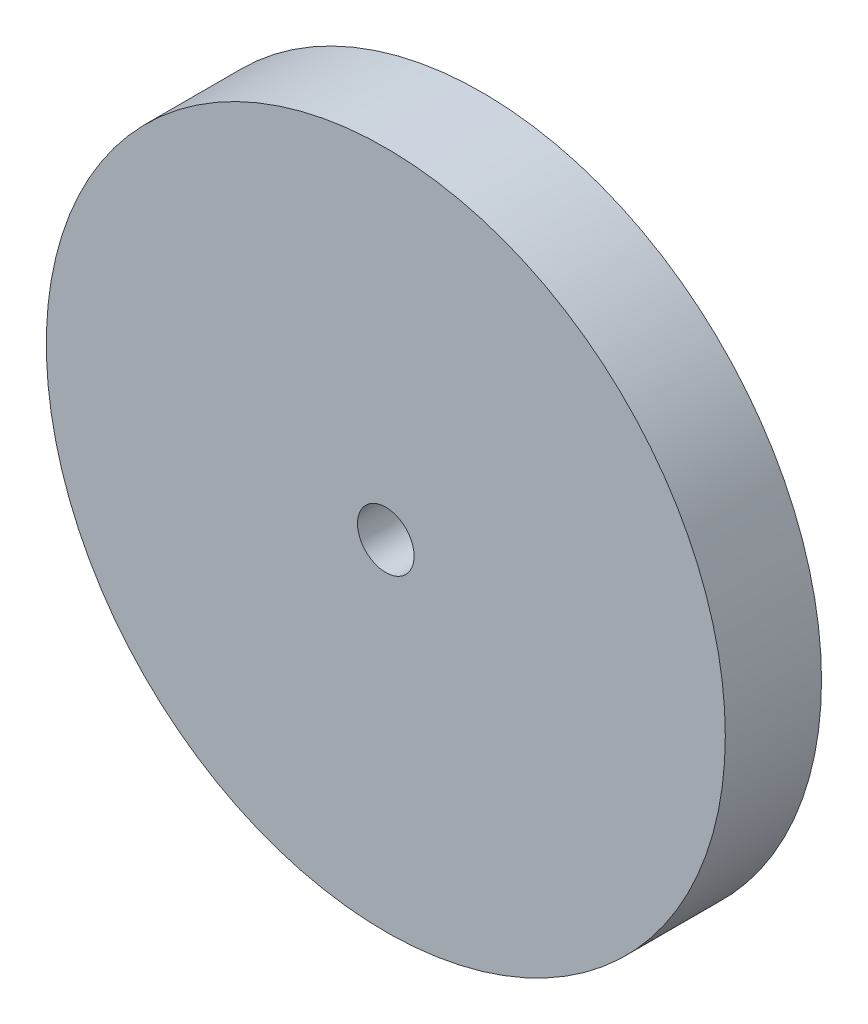
ISO-10303-21;
HEADER;
FILE_DESCRIPTION(('STEP AP214'),'2;1');
FILE_NAME('part.step','',(''),(''),'','','');
FILE_SCHEMA(('AUTOMOTIVE_DESIGN { 1 0 10303 214 1 1 1 1 }'));
ENDSEC;
DATA;
#1=APPLICATION_CONTEXT('core data for automotive mechanical design processes');
#2=APPLICATION_PROTOCOL_DEFINITION('international standard','automotive_design',2000,#1);
#3=PRODUCT_CONTEXT('',#1,'mechanical');
#4=PRODUCT('Part','Part','',(#3));
#5=PRODUCT_RELATED_PRODUCT_CATEGORY('part','',(#4));
#6=PRODUCT_DEFINITION_FORMATION('','',#4);
#7=PRODUCT_DEFINITION_CONTEXT('part definition',#1,'design');
#8=PRODUCT_DEFINITION('design','',#6,#7);
#9=PRODUCT_DEFINITION_SHAPE('','',#8);
#10=(LENGTH_UNIT() NAMED_UNIT(*) SI_UNIT(.MILLI.,.METRE.));
#11=(NAMED_UNIT(*) PLANE_ANGLE_UNIT() SI_UNIT($,.RADIAN.));
#12=(NAMED_UNIT(*) SI_UNIT($,.STERADIAN.) SOLID_ANGLE_UNIT());
#13=UNCERTAINTY_MEASURE_WITH_UNIT(LENGTH_MEASURE(1.E-05),#10,'distance_accuracy_value','');
#14=(GEOMETRIC_REPRESENTATION_CONTEXT(3) GLOBAL_UNCERTAINTY_ASSIGNED_CONTEXT((#13)) GLOBAL_UNIT_ASSIGNED_CONTEXT((#10,
#11,#12)) REPRESENTATION_CONTEXT('',''));
#15=CARTESIAN_POINT('',(0.,0.,0.));
#16=DIRECTION('',(0.,0.,1.));
#17=DIRECTION('',(1.,0.,0.));
#18=AXIS2_PLACEMENT_3D('',#15,#16,#17);
#19=CARTESIAN_POINT('',(0.,0.,8.5));
#20=DIRECTION('',(0.,0.,-1.));
#21=DIRECTION('',(-1.,0.,0.));
#22=AXIS2_PLACEMENT_3D('',#19,#20,#21);
#23=CYLINDRICAL_SURFACE('',#22,30.);
#24=CARTESIAN_POINT('',(0.,0.,8.5));
#25=DIRECTION('',(0.,0.,1.));
#26=DIRECTION('',(1.,0.,0.));
#27=AXIS2_PLACEMENT_3D('',#24,#25,#26);
#28=CIRCLE('',#27,30.);
#29=CARTESIAN_POINT('',(30.,0.,8.5));
#30=VERTEX_POINT('',#29);
#31=EDGE_CURVE('E38',#30,#30,#28,.T.);
#32=ORIENTED_EDGE('',*,*,#31,.F.);
#33=EDGE_LOOP('',(#32));
#34=FACE_BOUND('',#33,.T.);
#35=CARTESIAN_POINT('',(0.,0.,0.));
#36=DIRECTION('',(0.,0.,1.));
#37=DIRECTION('',(1.,0.,0.));
#38=AXIS2_PLACEMENT_3D('',#35,#36,#37);
#39=CIRCLE('',#38,30.);
#40=CARTESIAN_POINT('',(30.,0.,0.));
#41=VERTEX_POINT('',#40);
#42=EDGE_CURVE('E34',#41,#41,#39,.T.);
#43=ORIENTED_EDGE('',*,*,#42,.T.);
#44=EDGE_LOOP('',(#43));
#45=FACE_BOUND('',#44,.T.);
#46=ADVANCED_FACE('F31',(#34,#45),#23,.T.);
#47=CARTESIAN_POINT('',(0.,0.,8.5));
#48=DIRECTION('',(0.,0.,1.));
#49=DIRECTION('',(1.,0.,0.));
#50=AXIS2_PLACEMENT_3D('',#47,#48,#49);
#51=PLANE('',#50);
#52=CARTESIAN_POINT('',(0.,0.,8.5));
#53=DIRECTION('',(0.,0.,-1.));
#54=DIRECTION('',(-1.,0.,0.));
#55=AXIS2_PLACEMENT_3D('',#52,#53,#54);
#56=CIRCLE('',#55,2.5);
#57=CARTESIAN_POINT('',(-2.5,0.,8.5));
#58=VERTEX_POINT('',#57);
#59=EDGE_CURVE('E50',#58,#58,#56,.T.);
#60=ORIENTED_EDGE('',*,*,#59,.T.);
#61=EDGE_LOOP('',(#60));
#62=FACE_BOUND('',#61,.T.);
#63=ORIENTED_EDGE('',*,*,#31,.T.);
#64=EDGE_LOOP('',(#63));
#65=FACE_BOUND('',#64,.T.);
#66=ADVANCED_FACE('F54',(#62,#65),#51,.T.);
#67=CARTESIAN_POINT('',(0.,0.,0.));
#68=DIRECTION('',(0.,0.,1.));
#69=DIRECTION('',(1.,0.,0.));
#70=AXIS2_PLACEMENT_3D('',#67,#68,#69);
#71=PLANE('',#70);
#72=CARTESIAN_POINT('',(0.,0.,0.));
#73=DIRECTION('',(0.,0.,-1.));
#74=DIRECTION('',(-1.,0.,0.));
#75=AXIS2_PLACEMENT_3D('',#72,#73,#74);
#76=CIRCLE('',#75,6.);
#77=CARTESIAN_POINT('',(-6.,0.,0.));
#78=VERTEX_POINT('',#77);
#79=EDGE_CURVE('E10',#78,#78,#76,.T.);
#80=ORIENTED_EDGE('',*,*,#79,.F.);
#81=EDGE_LOOP('',(#80));
#82=FACE_BOUND('',#81,.T.);
#83=ORIENTED_EDGE('',*,*,#42,.F.);
#84=EDGE_LOOP('',(#83));
#85=FACE_BOUND('',#84,.T.);
#86=ADVANCED_FACE('F74',(#82,#85),#71,.F.);
#87=CARTESIAN_POINT('',(0.,0.,-10.));
#88=DIRECTION('',(0.,0.,-1.));
#89=DIRECTION('',(-1.,0.,0.));
#90=AXIS2_PLACEMENT_3D('',#87,#88,#89);
#91=PLANE('',#90);
#92=CARTESIAN_POINT('',(0.,0.,-10.));
#93=DIRECTION('',(0.,0.,-1.));
#94=DIRECTION('',(-1.,0.,0.));
#95=AXIS2_PLACEMENT_3D('',#92,#93,#94);
#96=CIRCLE('',#95,6.);
#97=CARTESIAN_POINT('',(-6.,0.,-10.));
#98=VERTEX_POINT('',#97);
#99=EDGE_CURVE('E44',#98,#98,#96,.T.);
#100=ORIENTED_EDGE('',*,*,#99,.T.);
#101=EDGE_LOOP('',(#100));
#102=FACE_BOUND('',#101,.T.);
#103=CARTESIAN_POINT('',(0.,0.,-10.));
#104=DIRECTION('',(0.,0.,-1.));
#105=DIRECTION('',(-1.,0.,0.));
#106=AXIS2_PLACEMENT_3D('',#103,#104,#105);
#107=CIRCLE('',#106,2.5);
#108=CARTESIAN_POINT('',(-2.5,0.,-10.));
#109=VERTEX_POINT('',#108);
#110=EDGE_CURVE('E47',#109,#109,#107,.T.);
#111=ORIENTED_EDGE('',*,*,#110,.F.);
#112=EDGE_LOOP('',(#111));
#113=FACE_BOUND('',#112,.T.);
#114=ADVANCED_FACE('F65',(#102,#113),#91,.T.);
#115=CARTESIAN_POINT('',(0.,0.,-10.));
#116=DIRECTION('',(0.,0.,1.));
#117=DIRECTION('',(1.,0.,0.));
#118=AXIS2_PLACEMENT_3D('',#115,#116,#117);
#119=CYLINDRICAL_SURFACE('',#118,6.);
#120=ORIENTED_EDGE('',*,*,#99,.F.);
#121=EDGE_LOOP('',(#120));
#122=FACE_BOUND('',#121,.T.);
#123=ORIENTED_EDGE('',*,*,#79,.T.);
#124=EDGE_LOOP('',(#123));
#125=FACE_BOUND('',#124,.T.);
#126=ADVANCED_FACE('F59',(#122,#125),#119,.T.);
#127=CARTESIAN_POINT('',(0.,0.,-10.));
#128=DIRECTION('',(0.,0.,1.));
#129=DIRECTION('',(1.,0.,0.));
#130=AXIS2_PLACEMENT_3D('',#127,#128,#129);
#131=CYLINDRICAL_SURFACE('',#130,2.5);
#132=ORIENTED_EDGE('',*,*,#110,.T.);
#133=EDGE_LOOP('',(#132));
#134=FACE_BOUND('',#133,.T.);
#135=ORIENTED_EDGE('',*,*,#59,.F.);
#136=EDGE_LOOP('',(#135));
#137=FACE_BOUND('',#136,.T.);
#138=ADVANCED_FACE('F57',(#134,#137),#131,.F.);
#139=CLOSED_SHELL('',(#46,#66,#86,#114,#126,#138));
#140=MANIFOLD_SOLID_BREP('B2',#139);
#141=ADVANCED_BREP_SHAPE_REPRESENTATION('',(#18,#140),#14);
#142=SHAPE_DEFINITION_REPRESENTATION(#9,#141);
ENDSEC;
END-ISO-10303-21;
